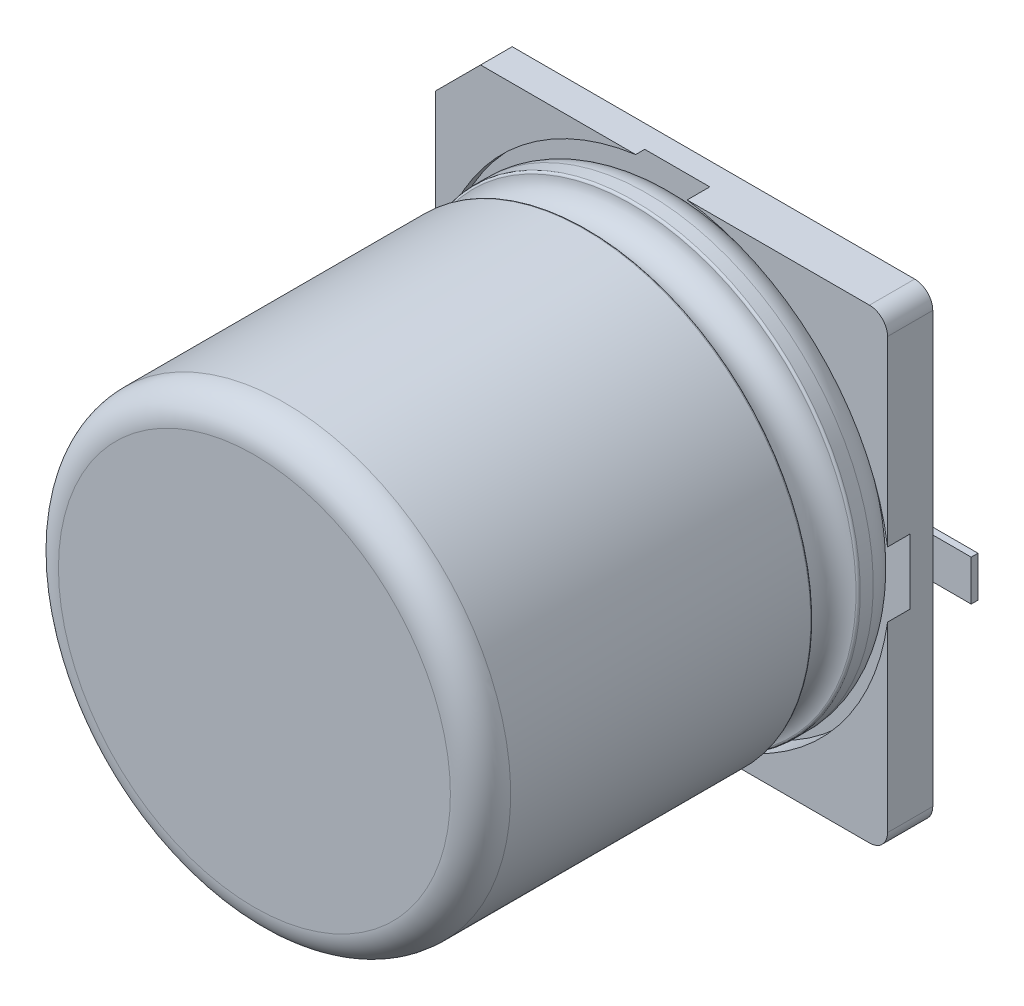
ISO-10303-21;
HEADER;
FILE_DESCRIPTION(('STEP AP214'),'2;1');
FILE_NAME('part.step','',(''),(''),'','','');
FILE_SCHEMA(('AUTOMOTIVE_DESIGN { 1 0 10303 214 1 1 1 1 }'));
ENDSEC;
DATA;
#1=APPLICATION_CONTEXT('core data for automotive mechanical design processes');
#2=APPLICATION_PROTOCOL_DEFINITION('international standard','automotive_design',2000,#1);
#3=PRODUCT_CONTEXT('',#1,'mechanical');
#4=PRODUCT('Part','Part','',(#3));
#5=PRODUCT_RELATED_PRODUCT_CATEGORY('part','',(#4));
#6=PRODUCT_DEFINITION_FORMATION('','',#4);
#7=PRODUCT_DEFINITION_CONTEXT('part definition',#1,'design');
#8=PRODUCT_DEFINITION('design','',#6,#7);
#9=PRODUCT_DEFINITION_SHAPE('','',#8);
#10=(LENGTH_UNIT() NAMED_UNIT(*) SI_UNIT(.MILLI.,.METRE.));
#11=(NAMED_UNIT(*) PLANE_ANGLE_UNIT() SI_UNIT($,.RADIAN.));
#12=(NAMED_UNIT(*) SI_UNIT($,.STERADIAN.) SOLID_ANGLE_UNIT());
#13=UNCERTAINTY_MEASURE_WITH_UNIT(LENGTH_MEASURE(1.E-05),#10,'distance_accuracy_value','');
#14=(GEOMETRIC_REPRESENTATION_CONTEXT(3) GLOBAL_UNCERTAINTY_ASSIGNED_CONTEXT((#13)) GLOBAL_UNIT_ASSIGNED_CONTEXT((#10,
#11,#12)) REPRESENTATION_CONTEXT('',''));
#15=CARTESIAN_POINT('',(0.,0.,0.));
#16=DIRECTION('',(0.,0.,1.));
#17=DIRECTION('',(1.,0.,0.));
#18=AXIS2_PLACEMENT_3D('',#15,#16,#17);
#19=CARTESIAN_POINT('',(4.251343967025,0.,0.15));
#20=DIRECTION('',(0.,0.,1.));
#21=DIRECTION('',(1.,0.,0.));
#22=AXIS2_PLACEMENT_3D('',#19,#20,#21);
#23=PLANE('',#22);
#24=DIRECTION('',(1.,0.,0.));
#25=VECTOR('',#24,1.);
#26=CARTESIAN_POINT('',(2.75000000001,-0.45000000001,0.15000000001));
#27=LINE('',#26,#25);
#28=CARTESIAN_POINT('',(5.15,-0.45,0.15));
#29=VERTEX_POINT('',#28);
#30=CARTESIAN_POINT('',(6.,-0.45,0.15));
#31=VERTEX_POINT('',#30);
#32=EDGE_CURVE('E480',#29,#31,#27,.T.);
#33=ORIENTED_EDGE('',*,*,#32,.T.);
#34=DIRECTION('',(0.,1.,0.));
#35=VECTOR('',#34,1.);
#36=CARTESIAN_POINT('',(6.00000000001,-0.45000000001,0.15000000001));
#37=LINE('',#36,#35);
#38=CARTESIAN_POINT('',(6.,0.45,0.15));
#39=VERTEX_POINT('',#38);
#40=EDGE_CURVE('E429',#31,#39,#37,.T.);
#41=ORIENTED_EDGE('',*,*,#40,.T.);
#42=DIRECTION('',(-1.,0.,0.));
#43=VECTOR('',#42,1.);
#44=CARTESIAN_POINT('',(6.00000000001,0.45000000001,0.15000000001));
#45=LINE('',#44,#43);
#46=CARTESIAN_POINT('',(5.15,0.45,0.15));
#47=VERTEX_POINT('',#46);
#48=EDGE_CURVE('E495',#39,#47,#45,.T.);
#49=ORIENTED_EDGE('',*,*,#48,.T.);
#50=DIRECTION('',(0.,1.,0.));
#51=VECTOR('',#50,1.);
#52=CARTESIAN_POINT('',(5.15000000001,-5.15000000001,0.15000000001));
#53=LINE('',#52,#51);
#54=EDGE_CURVE('E380',#29,#47,#53,.T.);
#55=ORIENTED_EDGE('',*,*,#54,.F.);
#56=EDGE_LOOP('',(#33,#41,#49,#55));
#57=FACE_BOUND('',#56,.T.);
#58=ADVANCED_FACE('F17',(#57),#23,.T.);
#59=CARTESIAN_POINT('',(0.161080870099,0.,1.15));
#60=DIRECTION('',(0.,0.,1.));
#61=DIRECTION('',(1.,0.,0.));
#62=AXIS2_PLACEMENT_3D('',#59,#60,#61);
#63=PLANE('',#62);
#64=CARTESIAN_POINT('',(4.75000000001,-4.75000000001,1.15000000001));
#65=DIRECTION('',(0.,0.,-1.));
#66=DIRECTION('',(0.,1.,0.));
#67=AXIS2_PLACEMENT_3D('',#64,#65,#66);
#68=CIRCLE('',#67,0.4);
#69=CARTESIAN_POINT('',(5.15,-4.75,1.15));
#70=VERTEX_POINT('',#69);
#71=CARTESIAN_POINT('',(4.75,-5.15,1.15));
#72=VERTEX_POINT('',#71);
#73=EDGE_CURVE('E11',#70,#72,#68,.T.);
#74=ORIENTED_EDGE('',*,*,#73,.F.);
#75=DIRECTION('',(0.,1.,0.));
#76=VECTOR('',#75,1.);
#77=CARTESIAN_POINT('',(5.15000000001,-5.15000000001,1.15000000001));
#78=LINE('',#77,#76);
#79=CARTESIAN_POINT('',(5.15,-0.719374728497,1.15));
#80=VERTEX_POINT('',#79);
#81=EDGE_CURVE('E281',#70,#80,#78,.T.);
#82=ORIENTED_EDGE('',*,*,#81,.T.);
#83=CARTESIAN_POINT('',(0.,0.,1.15000000001));
#84=DIRECTION('',(0.,0.,1.));
#85=DIRECTION('',(-1.,0.,0.));
#86=AXIS2_PLACEMENT_3D('',#83,#84,#85);
#87=CIRCLE('',#86,5.2);
#88=CARTESIAN_POINT('',(0.719374728497,-5.15,1.15));
#89=VERTEX_POINT('',#88);
#90=EDGE_CURVE('E518',#89,#80,#87,.T.);
#91=ORIENTED_EDGE('',*,*,#90,.F.);
#92=DIRECTION('',(1.,0.,0.));
#93=VECTOR('',#92,1.);
#94=CARTESIAN_POINT('',(-4.15000000001,-5.15000000001,1.15000000001));
#95=LINE('',#94,#93);
#96=EDGE_CURVE('E284',#89,#72,#95,.T.);
#97=ORIENTED_EDGE('',*,*,#96,.T.);
#98=EDGE_LOOP('',(#74,#82,#91,#97));
#99=FACE_BOUND('',#98,.T.);
#100=ADVANCED_FACE('F279',(#99),#63,.T.);
#101=CARTESIAN_POINT('',(4.75,-4.75,0.15));
#102=DIRECTION('',(0.,0.,-1.));
#103=DIRECTION('',(1.,0.,0.));
#104=AXIS2_PLACEMENT_3D('',#101,#102,#103);
#105=CYLINDRICAL_SURFACE('',#104,0.4);
#106=DIRECTION('',(0.,0.,1.));
#107=VECTOR('',#106,1.);
#108=CARTESIAN_POINT('',(5.15000000001,-4.75000000001,0.15000000001));
#109=LINE('',#108,#107);
#110=CARTESIAN_POINT('',(5.15,-4.75,0.15));
#111=VERTEX_POINT('',#110);
#112=EDGE_CURVE('E288',#111,#70,#109,.T.);
#113=ORIENTED_EDGE('',*,*,#112,.T.);
#114=ORIENTED_EDGE('',*,*,#73,.T.);
#115=DIRECTION('',(0.,0.,1.));
#116=VECTOR('',#115,1.);
#117=CARTESIAN_POINT('',(4.75000000001,-5.15000000001,0.15000000001));
#118=LINE('',#117,#116);
#119=CARTESIAN_POINT('',(4.75,-5.15,0.15));
#120=VERTEX_POINT('',#119);
#121=EDGE_CURVE('E463',#120,#72,#118,.T.);
#122=ORIENTED_EDGE('',*,*,#121,.F.);
#123=CARTESIAN_POINT('',(4.75000000001,-4.75000000001,0.15000000001));
#124=DIRECTION('',(0.,0.,-1.));
#125=DIRECTION('',(0.,1.,0.));
#126=AXIS2_PLACEMENT_3D('',#123,#124,#125);
#127=CIRCLE('',#126,0.4);
#128=EDGE_CURVE('E43',#111,#120,#127,.T.);
#129=ORIENTED_EDGE('',*,*,#128,.F.);
#130=EDGE_LOOP('',(#113,#114,#122,#129));
#131=FACE_BOUND('',#130,.T.);
#132=ADVANCED_FACE('F289',(#131),#105,.T.);
#133=CARTESIAN_POINT('',(4.75,4.75,0.15));
#134=DIRECTION('',(0.,0.,-1.));
#135=DIRECTION('',(0.,1.,0.));
#136=AXIS2_PLACEMENT_3D('',#133,#134,#135);
#137=CYLINDRICAL_SURFACE('',#136,0.4);
#138=DIRECTION('',(0.,0.,1.));
#139=VECTOR('',#138,1.);
#140=CARTESIAN_POINT('',(4.75000000001,5.15000000001,0.15000000001));
#141=LINE('',#140,#139);
#142=CARTESIAN_POINT('',(4.75,5.15,0.15));
#143=VERTEX_POINT('',#142);
#144=CARTESIAN_POINT('',(4.75,5.15,1.15));
#145=VERTEX_POINT('',#144);
#146=EDGE_CURVE('E331',#143,#145,#141,.T.);
#147=ORIENTED_EDGE('',*,*,#146,.T.);
#148=CARTESIAN_POINT('',(4.75000000001,4.75000000001,1.15000000001));
#149=DIRECTION('',(0.,0.,-1.));
#150=DIRECTION('',(0.,1.,0.));
#151=AXIS2_PLACEMENT_3D('',#148,#149,#150);
#152=CIRCLE('',#151,0.4);
#153=CARTESIAN_POINT('',(5.15,4.75,1.15));
#154=VERTEX_POINT('',#153);
#155=EDGE_CURVE('E30',#145,#154,#152,.T.);
#156=ORIENTED_EDGE('',*,*,#155,.T.);
#157=DIRECTION('',(0.,0.,1.));
#158=VECTOR('',#157,1.);
#159=CARTESIAN_POINT('',(5.15000000001,4.75000000001,0.15000000001));
#160=LINE('',#159,#158);
#161=CARTESIAN_POINT('',(5.15,4.75,0.15));
#162=VERTEX_POINT('',#161);
#163=EDGE_CURVE('E392',#162,#154,#160,.T.);
#164=ORIENTED_EDGE('',*,*,#163,.F.);
#165=CARTESIAN_POINT('',(4.75000000001,4.75000000001,0.15000000001));
#166=DIRECTION('',(0.,0.,-1.));
#167=DIRECTION('',(0.,1.,0.));
#168=AXIS2_PLACEMENT_3D('',#165,#166,#167);
#169=CIRCLE('',#168,0.4);
#170=EDGE_CURVE('E355',#143,#162,#169,.T.);
#171=ORIENTED_EDGE('',*,*,#170,.F.);
#172=EDGE_LOOP('',(#147,#156,#164,#171));
#173=FACE_BOUND('',#172,.T.);
#174=ADVANCED_FACE('F591',(#173),#137,.T.);
#175=CARTESIAN_POINT('',(0.161080870099,0.,1.15));
#176=DIRECTION('',(0.,0.,1.));
#177=DIRECTION('',(1.,0.,0.));
#178=AXIS2_PLACEMENT_3D('',#175,#176,#177);
#179=PLANE('',#178);
#180=CARTESIAN_POINT('',(0.,0.,1.15000000001));
#181=DIRECTION('',(0.,0.,1.));
#182=DIRECTION('',(-1.,0.,0.));
#183=AXIS2_PLACEMENT_3D('',#180,#181,#182);
#184=CIRCLE('',#183,5.2);
#185=CARTESIAN_POINT('',(5.15,0.719374728497,1.15));
#186=VERTEX_POINT('',#185);
#187=CARTESIAN_POINT('',(0.719374728497,5.15,1.15));
#188=VERTEX_POINT('',#187);
#189=EDGE_CURVE('E515',#186,#188,#184,.T.);
#190=ORIENTED_EDGE('',*,*,#189,.F.);
#191=DIRECTION('',(0.,1.,0.));
#192=VECTOR('',#191,1.);
#193=CARTESIAN_POINT('',(5.15000000001,-5.15000000001,1.15000000001));
#194=LINE('',#193,#192);
#195=EDGE_CURVE('E387',#186,#154,#194,.T.);
#196=ORIENTED_EDGE('',*,*,#195,.T.);
#197=ORIENTED_EDGE('',*,*,#155,.F.);
#198=DIRECTION('',(-1.,0.,0.));
#199=VECTOR('',#198,1.);
#200=CARTESIAN_POINT('',(5.15000000001,5.15000000001,1.15000000001));
#201=LINE('',#200,#199);
#202=EDGE_CURVE('E327',#145,#188,#201,.T.);
#203=ORIENTED_EDGE('',*,*,#202,.T.);
#204=EDGE_LOOP('',(#190,#196,#197,#203));
#205=FACE_BOUND('',#204,.T.);
#206=ADVANCED_FACE('F715',(#205),#179,.T.);
#207=CARTESIAN_POINT('',(0.,5.15,0.85));
#208=DIRECTION('',(0.,0.,1.));
#209=DIRECTION('',(1.,0.,0.));
#210=AXIS2_PLACEMENT_3D('',#207,#208,#209);
#211=PLANE('',#210);
#212=DIRECTION('',(-1.,0.,0.));
#213=VECTOR('',#212,1.);
#214=CARTESIAN_POINT('',(-1.00006306931016E-11,-5.15000000001,0.85000000001));
#215=LINE('',#214,#213);
#216=CARTESIAN_POINT('',(-0.719374728497,-5.15,0.85));
#217=VERTEX_POINT('',#216);
#218=CARTESIAN_POINT('',(-4.15,-5.15,0.85));
#219=VERTEX_POINT('',#218);
#220=EDGE_CURVE('E374',#217,#219,#215,.T.);
#221=ORIENTED_EDGE('',*,*,#220,.F.);
#222=CARTESIAN_POINT('',(0.,0.,0.85000000001));
#223=DIRECTION('',(0.,0.,-1.));
#224=DIRECTION('',(-1.,0.,0.));
#225=AXIS2_PLACEMENT_3D('',#222,#223,#224);
#226=CIRCLE('',#225,5.2);
#227=CARTESIAN_POINT('',(-5.15,-0.719374728497,0.85));
#228=VERTEX_POINT('',#227);
#229=EDGE_CURVE('E470',#217,#228,#226,.T.);
#230=ORIENTED_EDGE('',*,*,#229,.T.);
#231=DIRECTION('',(0.,-1.,0.));
#232=VECTOR('',#231,1.);
#233=CARTESIAN_POINT('',(-5.15000000001,5.15000000001,0.85000000001));
#234=LINE('',#233,#232);
#235=CARTESIAN_POINT('',(-5.15,-4.15,0.85));
#236=VERTEX_POINT('',#235);
#237=EDGE_CURVE('E326',#228,#236,#234,.T.);
#238=ORIENTED_EDGE('',*,*,#237,.T.);
#239=DIRECTION('',(0.707106781186548,-0.707106781186548,0.));
#240=VECTOR('',#239,1.);
#241=CARTESIAN_POINT('',(-6.18750000001,-3.11250000001,0.85000000001));
#242=LINE('',#241,#240);
#243=EDGE_CURVE('E386',#236,#219,#242,.T.);
#244=ORIENTED_EDGE('',*,*,#243,.T.);
#245=EDGE_LOOP('',(#221,#230,#238,#244));
#246=FACE_BOUND('',#245,.T.);
#247=ADVANCED_FACE('F668',(#246),#211,.T.);
#248=CARTESIAN_POINT('',(-5.15,-4.15,0.15));
#249=DIRECTION('',(0.707106781186548,0.707106781186548,0.));
#250=DIRECTION('',(0.,0.,-1.));
#251=AXIS2_PLACEMENT_3D('',#248,#249,#250);
#252=PLANE('',#251);
#253=DIRECTION('',(0.,0.,1.));
#254=VECTOR('',#253,1.);
#255=CARTESIAN_POINT('',(-4.15000000001,-5.15000000001,0.15000000001));
#256=LINE('',#255,#254);
#257=CARTESIAN_POINT('',(-4.15,-5.15,0.15));
#258=VERTEX_POINT('',#257);
#259=EDGE_CURVE('E378',#258,#219,#256,.T.);
#260=ORIENTED_EDGE('',*,*,#259,.T.);
#261=ORIENTED_EDGE('',*,*,#243,.F.);
#262=DIRECTION('',(0.,0.,1.));
#263=VECTOR('',#262,1.);
#264=CARTESIAN_POINT('',(-5.15000000001,-4.15000000001,0.15000000001));
#265=LINE('',#264,#263);
#266=CARTESIAN_POINT('',(-5.15,-4.15,0.15));
#267=VERTEX_POINT('',#266);
#268=EDGE_CURVE('E406',#267,#236,#265,.T.);
#269=ORIENTED_EDGE('',*,*,#268,.F.);
#270=DIRECTION('',(0.707106781186548,-0.707106781186548,0.));
#271=VECTOR('',#270,1.);
#272=CARTESIAN_POINT('',(-5.15000000001,-4.15000000001,0.15000000001));
#273=LINE('',#272,#271);
#274=EDGE_CURVE('E310',#267,#258,#273,.T.);
#275=ORIENTED_EDGE('',*,*,#274,.T.);
#276=EDGE_LOOP('',(#260,#261,#269,#275));
#277=FACE_BOUND('',#276,.T.);
#278=ADVANCED_FACE('F699',(#277),#252,.F.);
#279=CARTESIAN_POINT('',(-4.251343967025,0.,0.15));
#280=DIRECTION('',(0.,0.,1.));
#281=DIRECTION('',(1.,0.,0.));
#282=AXIS2_PLACEMENT_3D('',#279,#280,#281);
#283=PLANE('',#282);
#284=DIRECTION('',(-1.,0.,0.));
#285=VECTOR('',#284,1.);
#286=CARTESIAN_POINT('',(-2.75000000001,0.45000000001,0.15000000001));
#287=LINE('',#286,#285);
#288=CARTESIAN_POINT('',(-5.15,0.45,0.15));
#289=VERTEX_POINT('',#288);
#290=CARTESIAN_POINT('',(-6.,0.45,0.15));
#291=VERTEX_POINT('',#290);
#292=EDGE_CURVE('E348',#289,#291,#287,.T.);
#293=ORIENTED_EDGE('',*,*,#292,.T.);
#294=DIRECTION('',(0.,-1.,0.));
#295=VECTOR('',#294,1.);
#296=CARTESIAN_POINT('',(-6.00000000001,0.45000000001,0.15000000001));
#297=LINE('',#296,#295);
#298=CARTESIAN_POINT('',(-6.,-0.45,0.15));
#299=VERTEX_POINT('',#298);
#300=EDGE_CURVE('E434',#291,#299,#297,.T.);
#301=ORIENTED_EDGE('',*,*,#300,.T.);
#302=DIRECTION('',(1.,0.,0.));
#303=VECTOR('',#302,1.);
#304=CARTESIAN_POINT('',(-6.00000000001,-0.45000000001,0.15000000001));
#305=LINE('',#304,#303);
#306=CARTESIAN_POINT('',(-5.15,-0.45,0.15));
#307=VERTEX_POINT('',#306);
#308=EDGE_CURVE('E373',#299,#307,#305,.T.);
#309=ORIENTED_EDGE('',*,*,#308,.T.);
#310=DIRECTION('',(0.,-1.,0.));
#311=VECTOR('',#310,1.);
#312=CARTESIAN_POINT('',(-5.15000000001,4.15000000001,0.15000000001));
#313=LINE('',#312,#311);
#314=EDGE_CURVE('E528',#289,#307,#313,.T.);
#315=ORIENTED_EDGE('',*,*,#314,.F.);
#316=EDGE_LOOP('',(#293,#301,#309,#315));
#317=FACE_BOUND('',#316,.T.);
#318=ADVANCED_FACE('F695',(#317),#283,.T.);
#319=CARTESIAN_POINT('',(-4.15,5.15,0.15));
#320=DIRECTION('',(0.707106781186548,-0.707106781186548,0.));
#321=DIRECTION('',(0.,0.,-1.));
#322=AXIS2_PLACEMENT_3D('',#319,#320,#321);
#323=PLANE('',#322);
#324=DIRECTION('',(0.,0.,1.));
#325=VECTOR('',#324,1.);
#326=CARTESIAN_POINT('',(-5.15000000001,4.15000000001,0.15000000001));
#327=LINE('',#326,#325);
#328=CARTESIAN_POINT('',(-5.15,4.15,0.15));
#329=VERTEX_POINT('',#328);
#330=CARTESIAN_POINT('',(-5.15,4.15,0.85));
#331=VERTEX_POINT('',#330);
#332=EDGE_CURVE('E405',#329,#331,#327,.T.);
#333=ORIENTED_EDGE('',*,*,#332,.T.);
#334=DIRECTION('',(-0.707106781186548,-0.707106781186548,0.));
#335=VECTOR('',#334,1.);
#336=CARTESIAN_POINT('',(-3.11250000001,6.18750000001,0.85000000001));
#337=LINE('',#336,#335);
#338=CARTESIAN_POINT('',(-4.15,5.15,0.85));
#339=VERTEX_POINT('',#338);
#340=EDGE_CURVE('E316',#339,#331,#337,.T.);
#341=ORIENTED_EDGE('',*,*,#340,.F.);
#342=DIRECTION('',(0.,0.,1.));
#343=VECTOR('',#342,1.);
#344=CARTESIAN_POINT('',(-4.15000000001,5.15000000001,0.15000000001));
#345=LINE('',#344,#343);
#346=CARTESIAN_POINT('',(-4.15,5.15,0.15));
#347=VERTEX_POINT('',#346);
#348=EDGE_CURVE('E317',#347,#339,#345,.T.);
#349=ORIENTED_EDGE('',*,*,#348,.F.);
#350=DIRECTION('',(-0.707106781186548,-0.707106781186548,0.));
#351=VECTOR('',#350,1.);
#352=CARTESIAN_POINT('',(-4.15000000001,5.15000000001,0.15000000001));
#353=LINE('',#352,#351);
#354=EDGE_CURVE('E358',#347,#329,#353,.T.);
#355=ORIENTED_EDGE('',*,*,#354,.T.);
#356=EDGE_LOOP('',(#333,#341,#349,#355));
#357=FACE_BOUND('',#356,.T.);
#358=ADVANCED_FACE('F698',(#357),#323,.F.);
#359=CARTESIAN_POINT('',(0.161080870099,0.,0.15));
#360=DIRECTION('',(0.,0.,1.));
#361=DIRECTION('',(1.,0.,0.));
#362=AXIS2_PLACEMENT_3D('',#359,#360,#361);
#363=PLANE('',#362);
#364=DIRECTION('',(1.,0.,0.));
#365=VECTOR('',#364,1.);
#366=CARTESIAN_POINT('',(-4.15000000001,-5.15000000001,0.15000000001));
#367=LINE('',#366,#365);
#368=EDGE_CURVE('E459',#258,#120,#367,.T.);
#369=ORIENTED_EDGE('',*,*,#368,.F.);
#370=ORIENTED_EDGE('',*,*,#274,.F.);
#371=DIRECTION('',(0.,-1.,0.));
#372=VECTOR('',#371,1.);
#373=CARTESIAN_POINT('',(-5.15000000001,4.15000000001,0.15000000001));
#374=LINE('',#373,#372);
#375=EDGE_CURVE('E410',#307,#267,#374,.T.);
#376=ORIENTED_EDGE('',*,*,#375,.F.);
#377=DIRECTION('',(1.,0.,0.));
#378=VECTOR('',#377,1.);
#379=CARTESIAN_POINT('',(-6.00000000001,-0.45000000001,0.15000000001));
#380=LINE('',#379,#378);
#381=CARTESIAN_POINT('',(-2.75,-0.45,0.15));
#382=VERTEX_POINT('',#381);
#383=EDGE_CURVE('E499',#307,#382,#380,.T.);
#384=ORIENTED_EDGE('',*,*,#383,.T.);
#385=CARTESIAN_POINT('',(-2.75000000001,1.00003367778698E-11,0.15000000001));
#386=DIRECTION('',(0.,0.,1.));
#387=DIRECTION('',(0.,-1.,0.));
#388=AXIS2_PLACEMENT_3D('',#385,#386,#387);
#389=CIRCLE('',#388,0.45);
#390=CARTESIAN_POINT('',(-2.75,0.45,0.15));
#391=VERTEX_POINT('',#390);
#392=EDGE_CURVE('E362',#382,#391,#389,.T.);
#393=ORIENTED_EDGE('',*,*,#392,.T.);
#394=DIRECTION('',(-1.,0.,0.));
#395=VECTOR('',#394,1.);
#396=CARTESIAN_POINT('',(-2.75000000001,0.45000000001,0.15000000001));
#397=LINE('',#396,#395);
#398=EDGE_CURVE('E343',#391,#289,#397,.T.);
#399=ORIENTED_EDGE('',*,*,#398,.T.);
#400=DIRECTION('',(0.,-1.,0.));
#401=VECTOR('',#400,1.);
#402=CARTESIAN_POINT('',(-5.15000000001,4.15000000001,0.15000000001));
#403=LINE('',#402,#401);
#404=EDGE_CURVE('E417',#329,#289,#403,.T.);
#405=ORIENTED_EDGE('',*,*,#404,.F.);
#406=ORIENTED_EDGE('',*,*,#354,.F.);
#407=DIRECTION('',(-1.,0.,0.));
#408=VECTOR('',#407,1.);
#409=CARTESIAN_POINT('',(5.15000000001,5.15000000001,0.15000000001));
#410=LINE('',#409,#408);
#411=EDGE_CURVE('E438',#143,#347,#410,.T.);
#412=ORIENTED_EDGE('',*,*,#411,.F.);
#413=ORIENTED_EDGE('',*,*,#170,.T.);
#414=DIRECTION('',(0.,1.,0.));
#415=VECTOR('',#414,1.);
#416=CARTESIAN_POINT('',(5.15000000001,-5.15000000001,0.15000000001));
#417=LINE('',#416,#415);
#418=EDGE_CURVE('E383',#47,#162,#417,.T.);
#419=ORIENTED_EDGE('',*,*,#418,.F.);
#420=DIRECTION('',(-1.,0.,0.));
#421=VECTOR('',#420,1.);
#422=CARTESIAN_POINT('',(6.00000000001,0.45000000001,0.15000000001));
#423=LINE('',#422,#421);
#424=CARTESIAN_POINT('',(2.75,0.45,0.15));
#425=VERTEX_POINT('',#424);
#426=EDGE_CURVE('E402',#47,#425,#423,.T.);
#427=ORIENTED_EDGE('',*,*,#426,.T.);
#428=CARTESIAN_POINT('',(2.75000000001,-1.00006735557395E-11,0.15000000001));
#429=DIRECTION('',(0.,0.,1.));
#430=DIRECTION('',(0.,1.,0.));
#431=AXIS2_PLACEMENT_3D('',#428,#429,#430);
#432=CIRCLE('',#431,0.45);
#433=CARTESIAN_POINT('',(2.75,-0.45,0.15));
#434=VERTEX_POINT('',#433);
#435=EDGE_CURVE('E349',#425,#434,#432,.T.);
#436=ORIENTED_EDGE('',*,*,#435,.T.);
#437=DIRECTION('',(1.,0.,0.));
#438=VECTOR('',#437,1.);
#439=CARTESIAN_POINT('',(2.75000000001,-0.45000000001,0.15000000001));
#440=LINE('',#439,#438);
#441=EDGE_CURVE('E484',#434,#29,#440,.T.);
#442=ORIENTED_EDGE('',*,*,#441,.T.);
#443=DIRECTION('',(0.,1.,0.));
#444=VECTOR('',#443,1.);
#445=CARTESIAN_POINT('',(5.15000000001,-5.15000000001,0.15000000001));
#446=LINE('',#445,#444);
#447=EDGE_CURVE('E293',#111,#29,#446,.T.);
#448=ORIENTED_EDGE('',*,*,#447,.F.);
#449=ORIENTED_EDGE('',*,*,#128,.T.);
#450=EDGE_LOOP('',(#369,#370,#376,#384,#393,#399,#405,#406,#412,#413,#419,#427,#436,#442,#448,#449));
#451=FACE_BOUND('',#450,.T.);
#452=ADVANCED_FACE('F590',(#451),#363,.F.);
#453=CARTESIAN_POINT('',(4.95385262691188,-6.89398913789775E-13,2.64786830683542));
#454=CARTESIAN_POINT('',(4.95418832952667,-6.84922098620857E-13,2.64789895228371));
#455=CARTESIAN_POINT('',(4.95452403214146,-6.80445283451938E-13,2.647929597732));
#456=CARTESIAN_POINT('',(4.99997838105963,0.,2.65207901104621));
#457=CARTESIAN_POINT('',(4.9999783810603,-7.73144569199453E-13,2.697722557505));
#458=CARTESIAN_POINT('',(4.99997838106031,-7.7835762841376E-13,2.69806302843555));
#459=CARTESIAN_POINT('',(4.99997838106031,-7.83570687628069E-13,2.69840349936609));
#460=(BOUNDED_CURVE() B_SPLINE_CURVE(2,(#453,#454,#455,#456,#457,#458,#459),.UNSPECIFIED.,.F.,
.F.) B_SPLINE_CURVE_WITH_KNOTS((3,2,2,3),(-0.31415926535898,0.,31.415926535898,
31.7332273939105),
.UNSPECIFIED.) CURVE() GEOMETRIC_REPRESENTATION_ITEM() RATIONAL_B_SPLINE_CURVE((0.999999999999948,
0.999999999999948,0.999999999999948,0.738548945875826,0.999999999999948,0.999999999999948,0.999999999999948)) REPRESENTATION_ITEM(''));
#461=CARTESIAN_POINT('',(0.,0.,2.66401256438183));
#462=DIRECTION('',(0.,0.,-1.));
#463=AXIS1_PLACEMENT('',#461,#462);
#464=SURFACE_OF_REVOLUTION('',#460,#463);
#465=CARTESIAN_POINT('',(0.,0.,2.69772255750504));
#466=DIRECTION('',(0.,0.,-1.));
#467=DIRECTION('',(-1.,-4.06350350400321E-12,0.));
#468=AXIS2_PLACEMENT_3D('',#465,#466,#467);
#469=CIRCLE('',#468,4.9999783810603);
#470=CARTESIAN_POINT('',(-4.99997873873688,-2.03280668269901E-11,2.697722557505));
#471=VERTEX_POINT('',#470);
#472=EDGE_CURVE('E360',#471,#471,#469,.T.);
#473=ORIENTED_EDGE('',*,*,#472,.T.);
#474=EDGE_LOOP('',(#473));
#475=FACE_BOUND('',#474,.T.);
#476=CARTESIAN_POINT('',(0.,0.,2.647929597742));
#477=DIRECTION('',(0.,0.,-1.));
#478=DIRECTION('',(-1.,0.,0.));
#479=AXIS2_PLACEMENT_3D('',#476,#477,#478);
#480=CIRCLE('',#479,4.9545453);
#481=CARTESIAN_POINT('',(-4.954545454555,1.00006067550563E-11,2.647929597742));
#482=VERTEX_POINT('',#481);
#483=EDGE_CURVE('E341',#482,#482,#480,.T.);
#484=ORIENTED_EDGE('',*,*,#483,.F.);
#485=EDGE_LOOP('',(#484));
#486=FACE_BOUND('',#485,.T.);
#487=ADVANCED_FACE('F578',(#475,#486),#464,.F.);
#488=CARTESIAN_POINT('',(0.,0.,0.65));
#489=DIRECTION('',(0.,0.,1.));
#490=DIRECTION('',(-1.,0.,0.));
#491=AXIS2_PLACEMENT_3D('',#488,#489,#490);
#492=CYLINDRICAL_SURFACE('',#491,5.2);
#493=CARTESIAN_POINT('',(0.,0.,0.65000000001));
#494=DIRECTION('',(0.,0.,1.));
#495=DIRECTION('',(-1.,0.,0.));
#496=AXIS2_PLACEMENT_3D('',#493,#494,#495);
#497=CIRCLE('',#496,5.2);
#498=CARTESIAN_POINT('',(0.719374728497,-5.15,0.65));
#499=VERTEX_POINT('',#498);
#500=CARTESIAN_POINT('',(5.15,-0.719374728497,0.65));
#501=VERTEX_POINT('',#500);
#502=EDGE_CURVE('E479',#499,#501,#497,.T.);
#503=ORIENTED_EDGE('',*,*,#502,.F.);
#504=DIRECTION('',(0.,0.,-1.));
#505=VECTOR('',#504,1.);
#506=CARTESIAN_POINT('',(0.719374728507,-5.15000000001,0.65000000001));
#507=LINE('',#506,#505);
#508=EDGE_CURVE('E379',#89,#499,#507,.T.);
#509=ORIENTED_EDGE('',*,*,#508,.F.);
#510=ORIENTED_EDGE('',*,*,#90,.T.);
#511=DIRECTION('',(0.,0.,-1.));
#512=VECTOR('',#511,1.);
#513=CARTESIAN_POINT('',(5.15000000001,-0.719374728507,0.65000000001));
#514=LINE('',#513,#512);
#515=EDGE_CURVE('E299',#80,#501,#514,.T.);
#516=ORIENTED_EDGE('',*,*,#515,.T.);
#517=EDGE_LOOP('',(#503,#509,#510,#516));
#518=FACE_BOUND('',#517,.T.);
#519=ADVANCED_FACE('F589',(#518),#492,.F.);
#520=CARTESIAN_POINT('',(0.,0.,0.65));
#521=DIRECTION('',(0.,0.,1.));
#522=DIRECTION('',(-1.,0.,0.));
#523=AXIS2_PLACEMENT_3D('',#520,#521,#522);
#524=CYLINDRICAL_SURFACE('',#523,5.2);
#525=DIRECTION('',(0.,0.,-1.));
#526=VECTOR('',#525,1.);
#527=CARTESIAN_POINT('',(0.719374728507,5.15000000001,0.65000000001));
#528=LINE('',#527,#526);
#529=CARTESIAN_POINT('',(0.719374728497,5.15,0.65));
#530=VERTEX_POINT('',#529);
#531=EDGE_CURVE('E320',#188,#530,#528,.T.);
#532=ORIENTED_EDGE('',*,*,#531,.T.);
#533=CARTESIAN_POINT('',(0.,0.,0.65000000001));
#534=DIRECTION('',(0.,0.,1.));
#535=DIRECTION('',(-1.,0.,0.));
#536=AXIS2_PLACEMENT_3D('',#533,#534,#535);
#537=CIRCLE('',#536,5.2);
#538=CARTESIAN_POINT('',(5.15,0.719374728497,0.65));
#539=VERTEX_POINT('',#538);
#540=EDGE_CURVE('E428',#539,#530,#537,.T.);
#541=ORIENTED_EDGE('',*,*,#540,.F.);
#542=DIRECTION('',(0.,0.,-1.));
#543=VECTOR('',#542,1.);
#544=CARTESIAN_POINT('',(5.15000000001,0.719374728507,0.65000000001));
#545=LINE('',#544,#543);
#546=EDGE_CURVE('E391',#186,#539,#545,.T.);
#547=ORIENTED_EDGE('',*,*,#546,.F.);
#548=ORIENTED_EDGE('',*,*,#189,.T.);
#549=EDGE_LOOP('',(#532,#541,#547,#548));
#550=FACE_BOUND('',#549,.T.);
#551=ADVANCED_FACE('F704',(#550),#524,.F.);
#552=CARTESIAN_POINT('',(-4.15,-5.15,0.15));
#553=DIRECTION('',(0.,1.,0.));
#554=DIRECTION('',(0.,0.,-1.));
#555=AXIS2_PLACEMENT_3D('',#552,#553,#554);
#556=PLANE('',#555);
#557=ORIENTED_EDGE('',*,*,#96,.F.);
#558=ORIENTED_EDGE('',*,*,#508,.T.);
#559=DIRECTION('',(1.,0.,0.));
#560=VECTOR('',#559,1.);
#561=CARTESIAN_POINT('',(-2.07500000001,-5.15000000001,0.65000000001));
#562=LINE('',#561,#560);
#563=CARTESIAN_POINT('',(-0.719374728497,-5.15,0.65));
#564=VERTEX_POINT('',#563);
#565=EDGE_CURVE('E397',#564,#499,#562,.T.);
#566=ORIENTED_EDGE('',*,*,#565,.F.);
#567=DIRECTION('',(0.,0.,-1.));
#568=VECTOR('',#567,1.);
#569=CARTESIAN_POINT('',(-0.719374728507,-5.15000000001,0.65000000001));
#570=LINE('',#569,#568);
#571=EDGE_CURVE('E321',#217,#564,#570,.T.);
#572=ORIENTED_EDGE('',*,*,#571,.F.);
#573=ORIENTED_EDGE('',*,*,#220,.T.);
#574=ORIENTED_EDGE('',*,*,#259,.F.);
#575=ORIENTED_EDGE('',*,*,#368,.T.);
#576=ORIENTED_EDGE('',*,*,#121,.T.);
#577=EDGE_LOOP('',(#557,#558,#566,#572,#573,#574,#575,#576));
#578=FACE_BOUND('',#577,.T.);
#579=ADVANCED_FACE('F707',(#578),#556,.F.);
#580=CARTESIAN_POINT('',(5.15,5.15,0.15));
#581=DIRECTION('',(0.,-1.,0.));
#582=DIRECTION('',(-1.,0.,0.));
#583=AXIS2_PLACEMENT_3D('',#580,#581,#582);
#584=PLANE('',#583);
#585=ORIENTED_EDGE('',*,*,#348,.T.);
#586=DIRECTION('',(-1.,0.,0.));
#587=VECTOR('',#586,1.);
#588=CARTESIAN_POINT('',(1.00006306931016E-11,5.15000000001,0.85000000001));
#589=LINE('',#588,#587);
#590=CARTESIAN_POINT('',(-0.719374728497,5.15,0.85));
#591=VERTEX_POINT('',#590);
#592=EDGE_CURVE('E514',#591,#339,#589,.T.);
#593=ORIENTED_EDGE('',*,*,#592,.F.);
#594=DIRECTION('',(0.,0.,-1.));
#595=VECTOR('',#594,1.);
#596=CARTESIAN_POINT('',(-0.719374728507,5.15000000001,0.65000000001));
#597=LINE('',#596,#595);
#598=CARTESIAN_POINT('',(-0.719374728497,5.15,0.65));
#599=VERTEX_POINT('',#598);
#600=EDGE_CURVE('E467',#591,#599,#597,.T.);
#601=ORIENTED_EDGE('',*,*,#600,.T.);
#602=DIRECTION('',(-1.,0.,0.));
#603=VECTOR('',#602,1.);
#604=CARTESIAN_POINT('',(2.57500000001,5.15000000001,0.65000000001));
#605=LINE('',#604,#603);
#606=EDGE_CURVE('E342',#530,#599,#605,.T.);
#607=ORIENTED_EDGE('',*,*,#606,.F.);
#608=ORIENTED_EDGE('',*,*,#531,.F.);
#609=ORIENTED_EDGE('',*,*,#202,.F.);
#610=ORIENTED_EDGE('',*,*,#146,.F.);
#611=ORIENTED_EDGE('',*,*,#411,.T.);
#612=EDGE_LOOP('',(#585,#593,#601,#607,#608,#609,#610,#611));
#613=FACE_BOUND('',#612,.T.);
#614=ADVANCED_FACE('F19',(#613),#584,.F.);
#615=CARTESIAN_POINT('',(0.,0.,0.65));
#616=DIRECTION('',(0.,0.,1.));
#617=DIRECTION('',(-1.,0.,0.));
#618=AXIS2_PLACEMENT_3D('',#615,#616,#617);
#619=CYLINDRICAL_SURFACE('',#618,5.2);
#620=CARTESIAN_POINT('',(0.,0.,0.65000000001));
#621=DIRECTION('',(0.,0.,1.));
#622=DIRECTION('',(-1.,0.,0.));
#623=AXIS2_PLACEMENT_3D('',#620,#621,#622);
#624=CIRCLE('',#623,5.2);
#625=CARTESIAN_POINT('',(-5.15,-0.719374728497,0.65));
#626=VERTEX_POINT('',#625);
#627=EDGE_CURVE('E393',#626,#564,#624,.T.);
#628=ORIENTED_EDGE('',*,*,#627,.F.);
#629=DIRECTION('',(0.,0.,-1.));
#630=VECTOR('',#629,1.);
#631=CARTESIAN_POINT('',(-5.15000000001,-0.719374728507,0.65000000001));
#632=LINE('',#631,#630);
#633=EDGE_CURVE('E322',#228,#626,#632,.T.);
#634=ORIENTED_EDGE('',*,*,#633,.F.);
#635=ORIENTED_EDGE('',*,*,#229,.F.);
#636=ORIENTED_EDGE('',*,*,#571,.T.);
#637=EDGE_LOOP('',(#628,#634,#635,#636));
#638=FACE_BOUND('',#637,.T.);
#639=ADVANCED_FACE('F670',(#638),#619,.F.);
#640=CARTESIAN_POINT('',(0.,0.,0.65));
#641=DIRECTION('',(0.,0.,1.));
#642=DIRECTION('',(-1.,0.,0.));
#643=AXIS2_PLACEMENT_3D('',#640,#641,#642);
#644=CYLINDRICAL_SURFACE('',#643,5.2);
#645=CARTESIAN_POINT('',(0.,0.,0.85000000001));
#646=DIRECTION('',(0.,0.,-1.));
#647=DIRECTION('',(-1.,0.,0.));
#648=AXIS2_PLACEMENT_3D('',#645,#646,#647);
#649=CIRCLE('',#648,5.2);
#650=CARTESIAN_POINT('',(-5.15,0.719374728497,0.85));
#651=VERTEX_POINT('',#650);
#652=EDGE_CURVE('E510',#651,#591,#649,.T.);
#653=ORIENTED_EDGE('',*,*,#652,.F.);
#654=DIRECTION('',(0.,0.,-1.));
#655=VECTOR('',#654,1.);
#656=CARTESIAN_POINT('',(-5.15000000001,0.719374728507,0.65000000001));
#657=LINE('',#656,#655);
#658=CARTESIAN_POINT('',(-5.15,0.719374728497,0.65));
#659=VERTEX_POINT('',#658);
#660=EDGE_CURVE('E325',#651,#659,#657,.T.);
#661=ORIENTED_EDGE('',*,*,#660,.T.);
#662=CARTESIAN_POINT('',(0.,0.,0.65000000001));
#663=DIRECTION('',(0.,0.,1.));
#664=DIRECTION('',(-1.,0.,0.));
#665=AXIS2_PLACEMENT_3D('',#662,#663,#664);
#666=CIRCLE('',#665,5.2);
#667=EDGE_CURVE('E337',#599,#659,#666,.T.);
#668=ORIENTED_EDGE('',*,*,#667,.F.);
#669=ORIENTED_EDGE('',*,*,#600,.F.);
#670=EDGE_LOOP('',(#653,#661,#668,#669));
#671=FACE_BOUND('',#670,.T.);
#672=ADVANCED_FACE('F673',(#671),#644,.F.);
#673=CARTESIAN_POINT('',(-5.15,4.15,0.15));
#674=DIRECTION('',(1.,0.,0.));
#675=DIRECTION('',(0.,-1.,0.));
#676=AXIS2_PLACEMENT_3D('',#673,#674,#675);
#677=PLANE('',#676);
#678=ORIENTED_EDGE('',*,*,#314,.T.);
#679=ORIENTED_EDGE('',*,*,#375,.T.);
#680=ORIENTED_EDGE('',*,*,#268,.T.);
#681=ORIENTED_EDGE('',*,*,#237,.F.);
#682=ORIENTED_EDGE('',*,*,#633,.T.);
#683=DIRECTION('',(0.,-1.,0.));
#684=VECTOR('',#683,1.);
#685=CARTESIAN_POINT('',(-5.15000000001,2.07500000001,0.65000000001));
#686=LINE('',#685,#684);
#687=EDGE_CURVE('E398',#659,#626,#686,.T.);
#688=ORIENTED_EDGE('',*,*,#687,.F.);
#689=ORIENTED_EDGE('',*,*,#660,.F.);
#690=DIRECTION('',(0.,-1.,0.));
#691=VECTOR('',#690,1.);
#692=CARTESIAN_POINT('',(-5.15000000001,5.15000000001,0.85000000001));
#693=LINE('',#692,#691);
#694=EDGE_CURVE('E312',#331,#651,#693,.T.);
#695=ORIENTED_EDGE('',*,*,#694,.F.);
#696=ORIENTED_EDGE('',*,*,#332,.F.);
#697=ORIENTED_EDGE('',*,*,#404,.T.);
#698=EDGE_LOOP('',(#678,#679,#680,#681,#682,#688,#689,#695,#696,#697));
#699=FACE_BOUND('',#698,.T.);
#700=ADVANCED_FACE('F640',(#699),#677,.F.);
#701=CARTESIAN_POINT('',(0.,0.,2.15000000001));
#702=DIRECTION('',(0.,0.,1.));
#703=DIRECTION('',(1.,0.,0.));
#704=AXIS2_PLACEMENT_3D('',#701,#702,#703);
#705=TOROIDAL_SURFACE('',#704,5.,0.5);
#706=ORIENTED_EDGE('',*,*,#483,.T.);
#707=EDGE_LOOP('',(#706));
#708=FACE_BOUND('',#707,.T.);
#709=CARTESIAN_POINT('',(0.,0.,1.652070402278));
#710=DIRECTION('',(0.,0.,-1.));
#711=DIRECTION('',(-1.,0.,0.));
#712=AXIS2_PLACEMENT_3D('',#709,#710,#711);
#713=CIRCLE('',#712,4.9545453);
#714=CARTESIAN_POINT('',(-4.95454545455501,1.00006067558835E-11,1.652070402278));
#715=VERTEX_POINT('',#714);
#716=EDGE_CURVE('E335',#715,#715,#713,.T.);
#717=ORIENTED_EDGE('',*,*,#716,.F.);
#718=EDGE_LOOP('',(#717));
#719=FACE_BOUND('',#718,.T.);
#720=ADVANCED_FACE('F635',(#708,#719),#705,.F.);
#721=CARTESIAN_POINT('',(0.,0.,0.65));
#722=DIRECTION('',(0.,0.,1.));
#723=DIRECTION('',(1.,0.,0.));
#724=AXIS2_PLACEMENT_3D('',#721,#722,#723);
#725=PLANE('',#724);
#726=CARTESIAN_POINT('',(0.,0.,0.65000000001));
#727=DIRECTION('',(0.,0.,-1.));
#728=DIRECTION('',(-1.,0.,0.));
#729=AXIS2_PLACEMENT_3D('',#726,#727,#728);
#730=CIRCLE('',#729,4.3333333);
#731=CARTESIAN_POINT('',(-4.333333333343,1.00005306802796E-11,0.65000000001));
#732=VERTEX_POINT('',#731);
#733=EDGE_CURVE('E433',#732,#732,#730,.T.);
#734=ORIENTED_EDGE('',*,*,#733,.T.);
#735=EDGE_LOOP('',(#734));
#736=FACE_BOUND('',#735,.T.);
#737=ORIENTED_EDGE('',*,*,#687,.T.);
#738=ORIENTED_EDGE('',*,*,#627,.T.);
#739=ORIENTED_EDGE('',*,*,#565,.T.);
#740=ORIENTED_EDGE('',*,*,#502,.T.);
#741=DIRECTION('',(0.,1.,0.));
#742=VECTOR('',#741,1.);
#743=CARTESIAN_POINT('',(5.15000000001,-2.57500000001,0.65000000001));
#744=LINE('',#743,#742);
#745=EDGE_CURVE('E306',#501,#539,#744,.T.);
#746=ORIENTED_EDGE('',*,*,#745,.T.);
#747=ORIENTED_EDGE('',*,*,#540,.T.);
#748=ORIENTED_EDGE('',*,*,#606,.T.);
#749=ORIENTED_EDGE('',*,*,#667,.T.);
#750=EDGE_LOOP('',(#737,#738,#739,#740,#746,#747,#748,#749));
#751=FACE_BOUND('',#750,.T.);
#752=ADVANCED_FACE('F639',(#736,#751),#725,.T.);
#753=CARTESIAN_POINT('',(0.,0.,1.316666666667));
#754=DIRECTION('',(0.,0.,-1.));
#755=DIRECTION('',(-1.,0.,0.));
#756=AXIS2_PLACEMENT_3D('',#753,#754,#755);
#757=TOROIDAL_SURFACE('',#756,4.3333333,0.6666667);
#758=ORIENTED_EDGE('',*,*,#733,.F.);
#759=EDGE_LOOP('',(#758));
#760=FACE_BOUND('',#759,.T.);
#761=CARTESIAN_POINT('',(0.,0.,1.316666666677));
#762=DIRECTION('',(0.,0.,-1.));
#763=DIRECTION('',(-1.,0.,0.));
#764=AXIS2_PLACEMENT_3D('',#761,#762,#763);
#765=CIRCLE('',#764,5.);
#766=CARTESIAN_POINT('',(-5.00000000001,1.00006123233996E-11,1.316666666677));
#767=VERTEX_POINT('',#766);
#768=EDGE_CURVE('E445',#767,#767,#765,.T.);
#769=ORIENTED_EDGE('',*,*,#768,.T.);
#770=EDGE_LOOP('',(#769));
#771=FACE_BOUND('',#770,.T.);
#772=ADVANCED_FACE('F687',(#760,#771),#757,.T.);
#773=CARTESIAN_POINT('',(-4.251343967025,0.,0.));
#774=DIRECTION('',(0.,0.,1.));
#775=DIRECTION('',(1.,0.,0.));
#776=AXIS2_PLACEMENT_3D('',#773,#774,#775);
#777=PLANE('',#776);
#778=DIRECTION('',(-1.,0.,0.));
#779=VECTOR('',#778,1.);
#780=CARTESIAN_POINT('',(-2.75000000001,0.45000000001,0.));
#781=LINE('',#780,#779);
#782=CARTESIAN_POINT('',(-2.75,0.45,0.));
#783=VERTEX_POINT('',#782);
#784=CARTESIAN_POINT('',(-6.,0.45,0.));
#785=VERTEX_POINT('',#784);
#786=EDGE_CURVE('E372',#783,#785,#781,.T.);
#787=ORIENTED_EDGE('',*,*,#786,.F.);
#788=CARTESIAN_POINT('',(-2.75000000001,1.00003367778698E-11,0.));
#789=DIRECTION('',(0.,0.,1.));
#790=DIRECTION('',(0.,-1.,0.));
#791=AXIS2_PLACEMENT_3D('',#788,#789,#790);
#792=CIRCLE('',#791,0.45);
#793=CARTESIAN_POINT('',(-2.75,-0.45,0.));
#794=VERTEX_POINT('',#793);
#795=EDGE_CURVE('E315',#794,#783,#792,.T.);
#796=ORIENTED_EDGE('',*,*,#795,.F.);
#797=DIRECTION('',(1.,0.,0.));
#798=VECTOR('',#797,1.);
#799=CARTESIAN_POINT('',(-6.00000000001,-0.45000000001,0.));
#800=LINE('',#799,#798);
#801=CARTESIAN_POINT('',(-6.,-0.45,0.));
#802=VERTEX_POINT('',#801);
#803=EDGE_CURVE('E496',#802,#794,#800,.T.);
#804=ORIENTED_EDGE('',*,*,#803,.F.);
#805=DIRECTION('',(0.,-1.,0.));
#806=VECTOR('',#805,1.);
#807=CARTESIAN_POINT('',(-6.00000000001,0.45000000001,0.));
#808=LINE('',#807,#806);
#809=EDGE_CURVE('E551',#785,#802,#808,.T.);
#810=ORIENTED_EDGE('',*,*,#809,.F.);
#811=EDGE_LOOP('',(#787,#796,#804,#810));
#812=FACE_BOUND('',#811,.T.);
#813=ADVANCED_FACE('F684',(#812),#777,.F.);
#814=CARTESIAN_POINT('',(0.,0.,9.333333333333));
#815=DIRECTION('',(0.,0.,1.));
#816=DIRECTION('',(-1.,0.,0.));
#817=AXIS2_PLACEMENT_3D('',#814,#815,#816);
#818=TOROIDAL_SURFACE('',#817,4.3333333,0.6666667);
#819=CARTESIAN_POINT('',(0.,0.,10.00000000001));
#820=DIRECTION('',(0.,0.,-1.));
#821=DIRECTION('',(-1.,0.,0.));
#822=AXIS2_PLACEMENT_3D('',#819,#820,#821);
#823=CIRCLE('',#822,4.3333333);
#824=CARTESIAN_POINT('',(-4.333333333343,1.00005306802796E-11,10.00000000001));
#825=VERTEX_POINT('',#824);
#826=EDGE_CURVE('E332',#825,#825,#823,.T.);
#827=ORIENTED_EDGE('',*,*,#826,.T.);
#828=EDGE_LOOP('',(#827));
#829=FACE_BOUND('',#828,.T.);
#830=CARTESIAN_POINT('',(0.,0.,9.333333333343));
#831=DIRECTION('',(0.,0.,-1.));
#832=DIRECTION('',(-1.,0.,0.));
#833=AXIS2_PLACEMENT_3D('',#830,#831,#832);
#834=CIRCLE('',#833,5.);
#835=CARTESIAN_POINT('',(-5.00000000001,1.00006123233996E-11,9.333333333343));
#836=VERTEX_POINT('',#835);
#837=EDGE_CURVE('E500',#836,#836,#834,.T.);
#838=ORIENTED_EDGE('',*,*,#837,.F.);
#839=EDGE_LOOP('',(#838));
#840=FACE_BOUND('',#839,.T.);
#841=ADVANCED_FACE('F686',(#829,#840),#818,.T.);
#842=CARTESIAN_POINT('',(6.,-0.45,0.));
#843=DIRECTION('',(-1.,0.,0.));
#844=DIRECTION('',(0.,0.,1.));
#845=AXIS2_PLACEMENT_3D('',#842,#843,#844);
#846=PLANE('',#845);
#847=DIRECTION('',(0.,1.,0.));
#848=VECTOR('',#847,1.);
#849=CARTESIAN_POINT('',(6.00000000001,-0.45000000001,0.));
#850=LINE('',#849,#848);
#851=CARTESIAN_POINT('',(6.,-0.45,0.));
#852=VERTEX_POINT('',#851);
#853=CARTESIAN_POINT('',(6.,0.45,0.));
#854=VERTEX_POINT('',#853);
#855=EDGE_CURVE('E336',#852,#854,#850,.T.);
#856=ORIENTED_EDGE('',*,*,#855,.T.);
#857=DIRECTION('',(0.,0.,1.));
#858=VECTOR('',#857,1.);
#859=CARTESIAN_POINT('',(6.00000000001,0.45000000001,0.));
#860=LINE('',#859,#858);
#861=EDGE_CURVE('E488',#854,#39,#860,.T.);
#862=ORIENTED_EDGE('',*,*,#861,.T.);
#863=ORIENTED_EDGE('',*,*,#40,.F.);
#864=DIRECTION('',(0.,0.,1.));
#865=VECTOR('',#864,1.);
#866=CARTESIAN_POINT('',(6.00000000001,-0.45000000001,0.));
#867=LINE('',#866,#865);
#868=EDGE_CURVE('E353',#852,#31,#867,.T.);
#869=ORIENTED_EDGE('',*,*,#868,.F.);
#870=EDGE_LOOP('',(#856,#862,#863,#869));
#871=FACE_BOUND('',#870,.T.);
#872=ADVANCED_FACE('F721',(#871),#846,.F.);
#873=CARTESIAN_POINT('',(-6.,0.45,0.));
#874=DIRECTION('',(1.,0.,0.));
#875=DIRECTION('',(0.,-1.,0.));
#876=AXIS2_PLACEMENT_3D('',#873,#874,#875);
#877=PLANE('',#876);
#878=ORIENTED_EDGE('',*,*,#809,.T.);
#879=DIRECTION('',(0.,0.,1.));
#880=VECTOR('',#879,1.);
#881=CARTESIAN_POINT('',(-6.00000000001,-0.45000000001,0.));
#882=LINE('',#881,#880);
#883=EDGE_CURVE('E368',#802,#299,#882,.T.);
#884=ORIENTED_EDGE('',*,*,#883,.T.);
#885=ORIENTED_EDGE('',*,*,#300,.F.);
#886=DIRECTION('',(0.,0.,1.));
#887=VECTOR('',#886,1.);
#888=CARTESIAN_POINT('',(-6.00000000001,0.45000000001,0.));
#889=LINE('',#888,#887);
#890=EDGE_CURVE('E501',#785,#291,#889,.T.);
#891=ORIENTED_EDGE('',*,*,#890,.F.);
#892=EDGE_LOOP('',(#878,#884,#885,#891));
#893=FACE_BOUND('',#892,.T.);
#894=ADVANCED_FACE('F885',(#893),#877,.F.);
#895=CARTESIAN_POINT('',(2.75,-0.45,0.));
#896=DIRECTION('',(0.,1.,0.));
#897=DIRECTION('',(0.,0.,-1.));
#898=AXIS2_PLACEMENT_3D('',#895,#896,#897);
#899=PLANE('',#898);
#900=DIRECTION('',(1.,0.,0.));
#901=VECTOR('',#900,1.);
#902=CARTESIAN_POINT('',(2.75000000001,-0.45000000001,0.));
#903=LINE('',#902,#901);
#904=CARTESIAN_POINT('',(2.75,-0.45,0.));
#905=VERTEX_POINT('',#904);
#906=EDGE_CURVE('E420',#905,#852,#903,.T.);
#907=ORIENTED_EDGE('',*,*,#906,.T.);
#908=ORIENTED_EDGE('',*,*,#868,.T.);
#909=ORIENTED_EDGE('',*,*,#32,.F.);
#910=ORIENTED_EDGE('',*,*,#441,.F.);
#911=DIRECTION('',(0.,0.,1.));
#912=VECTOR('',#911,1.);
#913=CARTESIAN_POINT('',(2.75000000001,-0.45000000001,0.));
#914=LINE('',#913,#912);
#915=EDGE_CURVE('E354',#905,#434,#914,.T.);
#916=ORIENTED_EDGE('',*,*,#915,.F.);
#917=EDGE_LOOP('',(#907,#908,#909,#910,#916));
#918=FACE_BOUND('',#917,.T.);
#919=ADVANCED_FACE('F593',(#918),#899,.F.);
#920=CARTESIAN_POINT('',(2.75,0.,0.));
#921=DIRECTION('',(0.,0.,1.));
#922=DIRECTION('',(0.,1.,0.));
#923=AXIS2_PLACEMENT_3D('',#920,#921,#922);
#924=CYLINDRICAL_SURFACE('',#923,0.45);
#925=CARTESIAN_POINT('',(2.75000000001,-1.00006735557395E-11,0.));
#926=DIRECTION('',(0.,0.,1.));
#927=DIRECTION('',(0.,1.,0.));
#928=AXIS2_PLACEMENT_3D('',#925,#926,#927);
#929=CIRCLE('',#928,0.45);
#930=CARTESIAN_POINT('',(2.75,0.45,0.));
#931=VERTEX_POINT('',#930);
#932=EDGE_CURVE('E424',#931,#905,#929,.T.);
#933=ORIENTED_EDGE('',*,*,#932,.T.);
#934=ORIENTED_EDGE('',*,*,#915,.T.);
#935=ORIENTED_EDGE('',*,*,#435,.F.);
#936=DIRECTION('',(0.,0.,1.));
#937=VECTOR('',#936,1.);
#938=CARTESIAN_POINT('',(2.75000000001,0.45000000001,0.));
#939=LINE('',#938,#937);
#940=EDGE_CURVE('E347',#931,#425,#939,.T.);
#941=ORIENTED_EDGE('',*,*,#940,.F.);
#942=EDGE_LOOP('',(#933,#934,#935,#941));
#943=FACE_BOUND('',#942,.T.);
#944=ADVANCED_FACE('F693',(#943),#924,.T.);
#945=CARTESIAN_POINT('',(6.,0.45,0.));
#946=DIRECTION('',(0.,-1.,0.));
#947=DIRECTION('',(-1.,0.,0.));
#948=AXIS2_PLACEMENT_3D('',#945,#946,#947);
#949=PLANE('',#948);
#950=DIRECTION('',(-1.,0.,0.));
#951=VECTOR('',#950,1.);
#952=CARTESIAN_POINT('',(6.00000000001,0.45000000001,0.));
#953=LINE('',#952,#951);
#954=EDGE_CURVE('E414',#854,#931,#953,.T.);
#955=ORIENTED_EDGE('',*,*,#954,.T.);
#956=ORIENTED_EDGE('',*,*,#940,.T.);
#957=ORIENTED_EDGE('',*,*,#426,.F.);
#958=ORIENTED_EDGE('',*,*,#48,.F.);
#959=ORIENTED_EDGE('',*,*,#861,.F.);
#960=EDGE_LOOP('',(#955,#956,#957,#958,#959));
#961=FACE_BOUND('',#960,.T.);
#962=ADVANCED_FACE('F690',(#961),#949,.F.);
#963=CARTESIAN_POINT('',(-2.75,0.45,0.));
#964=DIRECTION('',(0.,-1.,0.));
#965=DIRECTION('',(-1.,0.,0.));
#966=AXIS2_PLACEMENT_3D('',#963,#964,#965);
#967=PLANE('',#966);
#968=ORIENTED_EDGE('',*,*,#786,.T.);
#969=ORIENTED_EDGE('',*,*,#890,.T.);
#970=ORIENTED_EDGE('',*,*,#292,.F.);
#971=ORIENTED_EDGE('',*,*,#398,.F.);
#972=DIRECTION('',(0.,0.,1.));
#973=VECTOR('',#972,1.);
#974=CARTESIAN_POINT('',(-2.75000000001,0.45000000001,0.));
#975=LINE('',#974,#973);
#976=EDGE_CURVE('E367',#783,#391,#975,.T.);
#977=ORIENTED_EDGE('',*,*,#976,.F.);
#978=EDGE_LOOP('',(#968,#969,#970,#971,#977));
#979=FACE_BOUND('',#978,.T.);
#980=ADVANCED_FACE('F682',(#979),#967,.F.);
#981=CARTESIAN_POINT('',(-6.,-0.45,0.));
#982=DIRECTION('',(0.,1.,0.));
#983=DIRECTION('',(0.,0.,-1.));
#984=AXIS2_PLACEMENT_3D('',#981,#982,#983);
#985=PLANE('',#984);
#986=ORIENTED_EDGE('',*,*,#803,.T.);
#987=DIRECTION('',(0.,0.,1.));
#988=VECTOR('',#987,1.);
#989=CARTESIAN_POINT('',(-2.75000000001,-0.45000000001,0.));
#990=LINE('',#989,#988);
#991=EDGE_CURVE('E366',#794,#382,#990,.T.);
#992=ORIENTED_EDGE('',*,*,#991,.T.);
#993=ORIENTED_EDGE('',*,*,#383,.F.);
#994=ORIENTED_EDGE('',*,*,#308,.F.);
#995=ORIENTED_EDGE('',*,*,#883,.F.);
#996=EDGE_LOOP('',(#986,#992,#993,#994,#995));
#997=FACE_BOUND('',#996,.T.);
#998=ADVANCED_FACE('F679',(#997),#985,.F.);
#999=CARTESIAN_POINT('',(0.,0.,2.65));
#1000=DIRECTION('',(0.,0.,-1.));
#1001=DIRECTION('',(-1.,0.,0.));
#1002=AXIS2_PLACEMENT_3D('',#999,#1000,#1001);
#1003=CYLINDRICAL_SURFACE('',#1002,5.);
#1004=ORIENTED_EDGE('',*,*,#837,.T.);
#1005=EDGE_LOOP('',(#1004));
#1006=FACE_BOUND('',#1005,.T.);
#1007=ORIENTED_EDGE('',*,*,#472,.F.);
#1008=EDGE_LOOP('',(#1007));
#1009=FACE_BOUND('',#1008,.T.);
#1010=ADVANCED_FACE('F648',(#1006,#1009),#1003,.T.);
#1011=CARTESIAN_POINT('',(4.99997838106037,-6.42606627632193E-13,1.602277442495));
#1012=CARTESIAN_POINT('',(4.99997838105994,-4.78279834760111E-13,1.64792098895355));
#1013=CARTESIAN_POINT('',(4.95452403214167,-7.1709131688195E-13,1.652070402268));
#1014=CARTESIAN_POINT('',(4.95418832952688,-7.18855056565791E-13,1.6521010477163));
#1015=CARTESIAN_POINT('',(4.95385262691209,-7.20618796249634E-13,1.65213169316459));
#1016=(BOUNDED_CURVE() B_SPLINE_CURVE(2,(#1011,#1012,#1013,#1014,#1015),.UNSPECIFIED.,.F.,
.F.) B_SPLINE_CURVE_WITH_KNOTS((3,2,3),(0.,31.415926535898,31.730085801257),
.UNSPECIFIED.) CURVE() GEOMETRIC_REPRESENTATION_ITEM() RATIONAL_B_SPLINE_CURVE((0.999999999999948,
0.738548945875895,0.999999999999948,0.999999999999948,0.999999999999948)) REPRESENTATION_ITEM(''));
#1017=CARTESIAN_POINT('',(0.,0.,1.63598743561811));
#1018=DIRECTION('',(0.,0.,-1.));
#1019=AXIS1_PLACEMENT('',#1017,#1018);
#1020=SURFACE_OF_REVOLUTION('',#1016,#1019);
#1021=ORIENTED_EDGE('',*,*,#716,.T.);
#1022=EDGE_LOOP('',(#1021));
#1023=FACE_BOUND('',#1022,.T.);
#1024=CARTESIAN_POINT('',(0.,0.,1.60227744249509));
#1025=DIRECTION('',(0.,0.,1.));
#1026=DIRECTION('',(-1.,0.,0.));
#1027=AXIS2_PLACEMENT_3D('',#1024,#1025,#1026);
#1028=CIRCLE('',#1027,4.99997838106037);
#1029=CARTESIAN_POINT('',(-5.,0.,1.602277442495));
#1030=VERTEX_POINT('',#1029);
#1031=EDGE_CURVE('E448',#1030,#1030,#1028,.F.);
#1032=ORIENTED_EDGE('',*,*,#1031,.F.);
#1033=EDGE_LOOP('',(#1032));
#1034=FACE_BOUND('',#1033,.T.);
#1035=ADVANCED_FACE('F644',(#1023,#1034),#1020,.F.);
#1036=CARTESIAN_POINT('',(0.,0.,10.));
#1037=DIRECTION('',(0.,0.,-1.));
#1038=DIRECTION('',(0.,-1.,0.));
#1039=AXIS2_PLACEMENT_3D('',#1036,#1037,#1038);
#1040=PLANE('',#1039);
#1041=ORIENTED_EDGE('',*,*,#826,.F.);
#1042=EDGE_LOOP('',(#1041));
#1043=FACE_BOUND('',#1042,.T.);
#1044=ADVANCED_FACE('F647',(#1043),#1040,.F.);
#1045=CARTESIAN_POINT('',(4.251343967025,0.,0.));
#1046=DIRECTION('',(0.,0.,1.));
#1047=DIRECTION('',(1.,0.,0.));
#1048=AXIS2_PLACEMENT_3D('',#1045,#1046,#1047);
#1049=PLANE('',#1048);
#1050=ORIENTED_EDGE('',*,*,#906,.F.);
#1051=ORIENTED_EDGE('',*,*,#932,.F.);
#1052=ORIENTED_EDGE('',*,*,#954,.F.);
#1053=ORIENTED_EDGE('',*,*,#855,.F.);
#1054=EDGE_LOOP('',(#1050,#1051,#1052,#1053));
#1055=FACE_BOUND('',#1054,.T.);
#1056=ADVANCED_FACE('F677',(#1055),#1049,.F.);
#1057=CARTESIAN_POINT('',(5.15,-5.15,0.15));
#1058=DIRECTION('',(-1.,0.,0.));
#1059=DIRECTION('',(0.,0.,1.));
#1060=AXIS2_PLACEMENT_3D('',#1057,#1058,#1059);
#1061=PLANE('',#1060);
#1062=ORIENTED_EDGE('',*,*,#54,.T.);
#1063=ORIENTED_EDGE('',*,*,#418,.T.);
#1064=ORIENTED_EDGE('',*,*,#163,.T.);
#1065=ORIENTED_EDGE('',*,*,#195,.F.);
#1066=ORIENTED_EDGE('',*,*,#546,.T.);
#1067=ORIENTED_EDGE('',*,*,#745,.F.);
#1068=ORIENTED_EDGE('',*,*,#515,.F.);
#1069=ORIENTED_EDGE('',*,*,#81,.F.);
#1070=ORIENTED_EDGE('',*,*,#112,.F.);
#1071=ORIENTED_EDGE('',*,*,#447,.T.);
#1072=EDGE_LOOP('',(#1062,#1063,#1064,#1065,#1066,#1067,#1068,#1069,#1070,#1071));
#1073=FACE_BOUND('',#1072,.T.);
#1074=ADVANCED_FACE('F296',(#1073),#1061,.F.);
#1075=CARTESIAN_POINT('',(-2.75,0.,0.));
#1076=DIRECTION('',(0.,0.,1.));
#1077=DIRECTION('',(0.,-1.,0.));
#1078=AXIS2_PLACEMENT_3D('',#1075,#1076,#1077);
#1079=CYLINDRICAL_SURFACE('',#1078,0.45);
#1080=ORIENTED_EDGE('',*,*,#795,.T.);
#1081=ORIENTED_EDGE('',*,*,#976,.T.);
#1082=ORIENTED_EDGE('',*,*,#392,.F.);
#1083=ORIENTED_EDGE('',*,*,#991,.F.);
#1084=EDGE_LOOP('',(#1080,#1081,#1082,#1083));
#1085=FACE_BOUND('',#1084,.T.);
#1086=ADVANCED_FACE('F783',(#1085),#1079,.T.);
#1087=CARTESIAN_POINT('',(0.,5.15,0.85));
#1088=DIRECTION('',(0.,0.,1.));
#1089=DIRECTION('',(1.,0.,0.));
#1090=AXIS2_PLACEMENT_3D('',#1087,#1088,#1089);
#1091=PLANE('',#1090);
#1092=ORIENTED_EDGE('',*,*,#652,.T.);
#1093=ORIENTED_EDGE('',*,*,#592,.T.);
#1094=ORIENTED_EDGE('',*,*,#340,.T.);
#1095=ORIENTED_EDGE('',*,*,#694,.T.);
#1096=EDGE_LOOP('',(#1092,#1093,#1094,#1095));
#1097=FACE_BOUND('',#1096,.T.);
#1098=ADVANCED_FACE('F667',(#1097),#1091,.T.);
#1099=CARTESIAN_POINT('',(0.,0.,0.65));
#1100=DIRECTION('',(0.,0.,-1.));
#1101=DIRECTION('',(-1.,0.,0.));
#1102=AXIS2_PLACEMENT_3D('',#1099,#1100,#1101);
#1103=CYLINDRICAL_SURFACE('',#1102,5.);
#1104=ORIENTED_EDGE('',*,*,#1031,.T.);
#1105=EDGE_LOOP('',(#1104));
#1106=FACE_BOUND('',#1105,.T.);
#1107=ORIENTED_EDGE('',*,*,#768,.F.);
#1108=EDGE_LOOP('',(#1107));
#1109=FACE_BOUND('',#1108,.T.);
#1110=ADVANCED_FACE('F657',(#1106,#1109),#1103,.T.);
#1111=CLOSED_SHELL('',(#58,#100,#132,#174,#206,#247,#278,#318,#358,#452,#487,#519,#551,#579,
#614,#639,#672,#700,#720,#752,#772,#813,#841,#872,#894,#919,#944,#962,#980,#998,#1010,#1035,
#1044,#1056,#1074,#1086,#1098,#1110));
#1112=MANIFOLD_SOLID_BREP('B1',#1111);
#1113=ADVANCED_BREP_SHAPE_REPRESENTATION('',(#18,#1112),#14);
#1114=SHAPE_DEFINITION_REPRESENTATION(#9,#1113);
ENDSEC;
END-ISO-10303-21;
